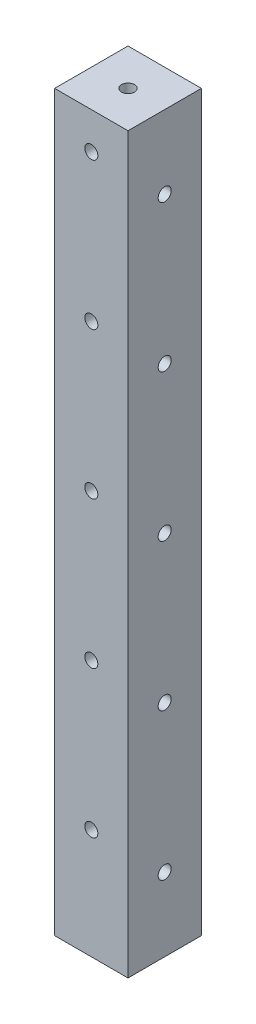
ISO-10303-21;
HEADER;
FILE_DESCRIPTION(('STEP AP214'),'2;1');
FILE_NAME('part.step','',(''),(''),'','','');
FILE_SCHEMA(('AUTOMOTIVE_DESIGN { 1 0 10303 214 1 1 1 1 }'));
ENDSEC;
DATA;
#1=APPLICATION_CONTEXT('core data for automotive mechanical design processes');
#2=APPLICATION_PROTOCOL_DEFINITION('international standard','automotive_design',2000,#1);
#3=PRODUCT_CONTEXT('',#1,'mechanical');
#4=PRODUCT('Part','Part','',(#3));
#5=PRODUCT_RELATED_PRODUCT_CATEGORY('part','',(#4));
#6=PRODUCT_DEFINITION_FORMATION('','',#4);
#7=PRODUCT_DEFINITION_CONTEXT('part definition',#1,'design');
#8=PRODUCT_DEFINITION('design','',#6,#7);
#9=PRODUCT_DEFINITION_SHAPE('','',#8);
#10=(LENGTH_UNIT() NAMED_UNIT(*) SI_UNIT(.MILLI.,.METRE.));
#11=(NAMED_UNIT(*) PLANE_ANGLE_UNIT() SI_UNIT($,.RADIAN.));
#12=(NAMED_UNIT(*) SI_UNIT($,.STERADIAN.) SOLID_ANGLE_UNIT());
#13=UNCERTAINTY_MEASURE_WITH_UNIT(LENGTH_MEASURE(1.E-05),#10,'distance_accuracy_value','');
#14=(GEOMETRIC_REPRESENTATION_CONTEXT(3) GLOBAL_UNCERTAINTY_ASSIGNED_CONTEXT((#13)) GLOBAL_UNIT_ASSIGNED_CONTEXT((#10,
#11,#12)) REPRESENTATION_CONTEXT('',''));
#15=CARTESIAN_POINT('',(0.,0.,0.));
#16=DIRECTION('',(0.,0.,1.));
#17=DIRECTION('',(1.,0.,0.));
#18=AXIS2_PLACEMENT_3D('',#15,#16,#17);
#19=CARTESIAN_POINT('',(6.35,127.,6.35));
#20=DIRECTION('',(0.,1.,0.));
#21=DIRECTION('',(0.,0.,1.));
#22=AXIS2_PLACEMENT_3D('',#19,#20,#21);
#23=CYLINDRICAL_SURFACE('',#22,1.1303);
#24=CARTESIAN_POINT('',(6.35,127.,6.35));
#25=DIRECTION('',(0.,1.,0.));
#26=DIRECTION('',(0.,0.,1.));
#27=AXIS2_PLACEMENT_3D('',#24,#25,#26);
#28=CIRCLE('',#27,1.1303);
#29=CARTESIAN_POINT('',(6.35,127.,7.4803));
#30=VERTEX_POINT('',#29);
#31=EDGE_CURVE('E170',#30,#30,#28,.T.);
#32=ORIENTED_EDGE('',*,*,#31,.T.);
#33=EDGE_LOOP('',(#32));
#34=FACE_BOUND('',#33,.T.);
#35=CARTESIAN_POINT('',(6.35,120.65,6.35));
#36=DIRECTION('',(0.,0.707106781186547,0.707106781186547));
#37=DIRECTION('',(0.,0.707106781186547,-0.707106781186547));
#38=AXIS2_PLACEMENT_3D('',#35,#36,#37);
#39=ELLIPSE('',#38,1.5984855895503,1.13029999999999);
#40=CARTESIAN_POINT('',(5.2197,120.65,6.35));
#41=VERTEX_POINT('',#40);
#42=CARTESIAN_POINT('',(7.48029999999999,120.65,6.35));
#43=VERTEX_POINT('',#42);
#44=EDGE_CURVE('E59',#41,#43,#39,.F.);
#45=ORIENTED_EDGE('',*,*,#44,.T.);
#46=CARTESIAN_POINT('',(6.35,120.65,6.35));
#47=DIRECTION('',(0.,0.707106781186547,-0.707106781186547));
#48=DIRECTION('',(0.,0.707106781186547,0.707106781186547));
#49=AXIS2_PLACEMENT_3D('',#46,#47,#48);
#50=ELLIPSE('',#49,1.5984855895503,1.13029999999999);
#51=EDGE_CURVE('E11',#43,#41,#50,.F.);
#52=ORIENTED_EDGE('',*,*,#51,.T.);
#53=EDGE_LOOP('',(#45,#52));
#54=FACE_BOUND('',#53,.T.);
#55=ADVANCED_FACE('F45',(#34,#54),#23,.F.);
#56=CARTESIAN_POINT('',(0.,127.,0.));
#57=DIRECTION('',(1.,0.,0.));
#58=DIRECTION('',(0.,0.,-1.));
#59=AXIS2_PLACEMENT_3D('',#56,#57,#58);
#60=PLANE('',#59);
#61=CARTESIAN_POINT('',(0.,12.7,6.35));
#62=DIRECTION('',(-1.,0.,0.));
#63=DIRECTION('',(0.,0.,1.));
#64=AXIS2_PLACEMENT_3D('',#61,#62,#63);
#65=CIRCLE('',#64,1.13029999999999);
#66=CARTESIAN_POINT('',(0.,12.7,7.48029999999999));
#67=VERTEX_POINT('',#66);
#68=EDGE_CURVE('E250',#67,#67,#65,.T.);
#69=ORIENTED_EDGE('',*,*,#68,.F.);
#70=EDGE_LOOP('',(#69));
#71=FACE_BOUND('',#70,.T.);
#72=CARTESIAN_POINT('',(0.,38.1,6.35));
#73=DIRECTION('',(-1.,0.,0.));
#74=DIRECTION('',(0.,0.,1.));
#75=AXIS2_PLACEMENT_3D('',#72,#73,#74);
#76=CIRCLE('',#75,1.13029999999999);
#77=CARTESIAN_POINT('',(0.,38.1,7.48029999999999));
#78=VERTEX_POINT('',#77);
#79=EDGE_CURVE('E242',#78,#78,#76,.T.);
#80=ORIENTED_EDGE('',*,*,#79,.F.);
#81=EDGE_LOOP('',(#80));
#82=FACE_BOUND('',#81,.T.);
#83=CARTESIAN_POINT('',(0.,63.5,6.35));
#84=DIRECTION('',(-1.,0.,0.));
#85=DIRECTION('',(0.,0.,1.));
#86=AXIS2_PLACEMENT_3D('',#83,#84,#85);
#87=CIRCLE('',#86,1.13029999999999);
#88=CARTESIAN_POINT('',(0.,63.5,7.48029999999999));
#89=VERTEX_POINT('',#88);
#90=EDGE_CURVE('E234',#89,#89,#87,.T.);
#91=ORIENTED_EDGE('',*,*,#90,.F.);
#92=EDGE_LOOP('',(#91));
#93=FACE_BOUND('',#92,.T.);
#94=CARTESIAN_POINT('',(0.,88.9,6.35));
#95=DIRECTION('',(-1.,0.,0.));
#96=DIRECTION('',(0.,0.,1.));
#97=AXIS2_PLACEMENT_3D('',#94,#95,#96);
#98=CIRCLE('',#97,1.13029999999999);
#99=CARTESIAN_POINT('',(0.,88.9,7.48029999999999));
#100=VERTEX_POINT('',#99);
#101=EDGE_CURVE('E226',#100,#100,#98,.T.);
#102=ORIENTED_EDGE('',*,*,#101,.F.);
#103=EDGE_LOOP('',(#102));
#104=FACE_BOUND('',#103,.T.);
#105=CARTESIAN_POINT('',(0.,114.3,6.35));
#106=DIRECTION('',(-1.,0.,0.));
#107=DIRECTION('',(0.,0.,1.));
#108=AXIS2_PLACEMENT_3D('',#105,#106,#107);
#109=CIRCLE('',#108,1.13029999999999);
#110=CARTESIAN_POINT('',(0.,114.3,7.48029999999999));
#111=VERTEX_POINT('',#110);
#112=EDGE_CURVE('E218',#111,#111,#109,.T.);
#113=ORIENTED_EDGE('',*,*,#112,.F.);
#114=EDGE_LOOP('',(#113));
#115=FACE_BOUND('',#114,.T.);
#116=DIRECTION('',(0.,0.,1.));
#117=VECTOR('',#116,1.);
#118=CARTESIAN_POINT('',(0.,0.,0.));
#119=LINE('',#118,#117);
#120=CARTESIAN_POINT('',(0.,0.,0.));
#121=VERTEX_POINT('',#120);
#122=CARTESIAN_POINT('',(0.,0.,12.7));
#123=VERTEX_POINT('',#122);
#124=EDGE_CURVE('E145',#121,#123,#119,.T.);
#125=ORIENTED_EDGE('',*,*,#124,.T.);
#126=DIRECTION('',(0.,-1.,0.));
#127=VECTOR('',#126,1.);
#128=CARTESIAN_POINT('',(0.,127.,12.7));
#129=LINE('',#128,#127);
#130=CARTESIAN_POINT('',(0.,127.,12.7));
#131=VERTEX_POINT('',#130);
#132=EDGE_CURVE('E118',#131,#123,#129,.T.);
#133=ORIENTED_EDGE('',*,*,#132,.F.);
#134=DIRECTION('',(0.,0.,1.));
#135=VECTOR('',#134,1.);
#136=CARTESIAN_POINT('',(0.,127.,0.));
#137=LINE('',#136,#135);
#138=CARTESIAN_POINT('',(0.,127.,0.));
#139=VERTEX_POINT('',#138);
#140=EDGE_CURVE('E138',#139,#131,#137,.T.);
#141=ORIENTED_EDGE('',*,*,#140,.F.);
#142=DIRECTION('',(0.,-1.,0.));
#143=VECTOR('',#142,1.);
#144=CARTESIAN_POINT('',(0.,127.,0.));
#145=LINE('',#144,#143);
#146=EDGE_CURVE('E133',#139,#121,#145,.T.);
#147=ORIENTED_EDGE('',*,*,#146,.T.);
#148=EDGE_LOOP('',(#125,#133,#141,#147));
#149=FACE_BOUND('',#148,.T.);
#150=ADVANCED_FACE('F47',(#71,#82,#93,#104,#115,#149),#60,.F.);
#151=CARTESIAN_POINT('',(0.,127.,12.7));
#152=DIRECTION('',(0.,0.,-1.));
#153=DIRECTION('',(-1.,0.,0.));
#154=AXIS2_PLACEMENT_3D('',#151,#152,#153);
#155=PLANE('',#154);
#156=CARTESIAN_POINT('',(6.35,19.05,12.7));
#157=DIRECTION('',(0.,0.,-1.));
#158=DIRECTION('',(-1.,0.,0.));
#159=AXIS2_PLACEMENT_3D('',#156,#157,#158);
#160=CIRCLE('',#159,1.1303);
#161=CARTESIAN_POINT('',(5.2197,19.05,12.7));
#162=VERTEX_POINT('',#161);
#163=EDGE_CURVE('E206',#162,#162,#160,.T.);
#164=ORIENTED_EDGE('',*,*,#163,.T.);
#165=EDGE_LOOP('',(#164));
#166=FACE_BOUND('',#165,.T.);
#167=CARTESIAN_POINT('',(6.35,44.45,12.7));
#168=DIRECTION('',(0.,0.,-1.));
#169=DIRECTION('',(-1.,0.,0.));
#170=AXIS2_PLACEMENT_3D('',#167,#168,#169);
#171=CIRCLE('',#170,1.1303);
#172=CARTESIAN_POINT('',(5.2197,44.45,12.7));
#173=VERTEX_POINT('',#172);
#174=EDGE_CURVE('E198',#173,#173,#171,.T.);
#175=ORIENTED_EDGE('',*,*,#174,.T.);
#176=EDGE_LOOP('',(#175));
#177=FACE_BOUND('',#176,.T.);
#178=CARTESIAN_POINT('',(6.35,69.85,12.7));
#179=DIRECTION('',(0.,0.,-1.));
#180=DIRECTION('',(-1.,0.,0.));
#181=AXIS2_PLACEMENT_3D('',#178,#179,#180);
#182=CIRCLE('',#181,1.1303);
#183=CARTESIAN_POINT('',(5.2197,69.85,12.7));
#184=VERTEX_POINT('',#183);
#185=EDGE_CURVE('E190',#184,#184,#182,.T.);
#186=ORIENTED_EDGE('',*,*,#185,.T.);
#187=EDGE_LOOP('',(#186));
#188=FACE_BOUND('',#187,.T.);
#189=CARTESIAN_POINT('',(6.35,95.25,12.7));
#190=DIRECTION('',(0.,0.,-1.));
#191=DIRECTION('',(-1.,0.,0.));
#192=AXIS2_PLACEMENT_3D('',#189,#190,#191);
#193=CIRCLE('',#192,1.1303);
#194=CARTESIAN_POINT('',(5.2197,95.25,12.7));
#195=VERTEX_POINT('',#194);
#196=EDGE_CURVE('E182',#195,#195,#193,.T.);
#197=ORIENTED_EDGE('',*,*,#196,.T.);
#198=EDGE_LOOP('',(#197));
#199=FACE_BOUND('',#198,.T.);
#200=CARTESIAN_POINT('',(6.35,120.65,12.7));
#201=DIRECTION('',(0.,0.,-1.));
#202=DIRECTION('',(-1.,0.,0.));
#203=AXIS2_PLACEMENT_3D('',#200,#201,#202);
#204=CIRCLE('',#203,1.1303);
#205=CARTESIAN_POINT('',(5.2197,120.65,12.7));
#206=VERTEX_POINT('',#205);
#207=EDGE_CURVE('E174',#206,#206,#204,.T.);
#208=ORIENTED_EDGE('',*,*,#207,.T.);
#209=EDGE_LOOP('',(#208));
#210=FACE_BOUND('',#209,.T.);
#211=DIRECTION('',(1.,0.,0.));
#212=VECTOR('',#211,1.);
#213=CARTESIAN_POINT('',(0.,0.,12.7));
#214=LINE('',#213,#212);
#215=CARTESIAN_POINT('',(12.7,0.,12.7));
#216=VERTEX_POINT('',#215);
#217=EDGE_CURVE('E142',#123,#216,#214,.T.);
#218=ORIENTED_EDGE('',*,*,#217,.T.);
#219=DIRECTION('',(0.,-1.,0.));
#220=VECTOR('',#219,1.);
#221=CARTESIAN_POINT('',(12.7,127.,12.7));
#222=LINE('',#221,#220);
#223=CARTESIAN_POINT('',(12.7,127.,12.7));
#224=VERTEX_POINT('',#223);
#225=EDGE_CURVE('E126',#224,#216,#222,.T.);
#226=ORIENTED_EDGE('',*,*,#225,.F.);
#227=DIRECTION('',(1.,0.,0.));
#228=VECTOR('',#227,1.);
#229=CARTESIAN_POINT('',(0.,127.,12.7));
#230=LINE('',#229,#228);
#231=EDGE_CURVE('E97',#131,#224,#230,.T.);
#232=ORIENTED_EDGE('',*,*,#231,.F.);
#233=ORIENTED_EDGE('',*,*,#132,.T.);
#234=EDGE_LOOP('',(#218,#226,#232,#233));
#235=FACE_BOUND('',#234,.T.);
#236=ADVANCED_FACE('F259',(#166,#177,#188,#199,#210,#235),#155,.F.);
#237=CARTESIAN_POINT('',(12.7,127.,0.));
#238=DIRECTION('',(-1.,0.,0.));
#239=DIRECTION('',(0.,0.,1.));
#240=AXIS2_PLACEMENT_3D('',#237,#238,#239);
#241=PLANE('',#240);
#242=CARTESIAN_POINT('',(12.7,12.7,6.35));
#243=DIRECTION('',(-1.,0.,0.));
#244=DIRECTION('',(0.,0.,1.));
#245=AXIS2_PLACEMENT_3D('',#242,#243,#244);
#246=CIRCLE('',#245,1.1303);
#247=CARTESIAN_POINT('',(12.7,12.7,7.48029999999999));
#248=VERTEX_POINT('',#247);
#249=EDGE_CURVE('E246',#248,#248,#246,.T.);
#250=ORIENTED_EDGE('',*,*,#249,.T.);
#251=EDGE_LOOP('',(#250));
#252=FACE_BOUND('',#251,.T.);
#253=CARTESIAN_POINT('',(12.7,38.1,6.35));
#254=DIRECTION('',(-1.,0.,0.));
#255=DIRECTION('',(0.,0.,1.));
#256=AXIS2_PLACEMENT_3D('',#253,#254,#255);
#257=CIRCLE('',#256,1.13029999999999);
#258=CARTESIAN_POINT('',(12.7,38.1,7.48029999999999));
#259=VERTEX_POINT('',#258);
#260=EDGE_CURVE('E238',#259,#259,#257,.T.);
#261=ORIENTED_EDGE('',*,*,#260,.T.);
#262=EDGE_LOOP('',(#261));
#263=FACE_BOUND('',#262,.T.);
#264=CARTESIAN_POINT('',(12.7,63.5,6.35));
#265=DIRECTION('',(-1.,0.,0.));
#266=DIRECTION('',(0.,0.,1.));
#267=AXIS2_PLACEMENT_3D('',#264,#265,#266);
#268=CIRCLE('',#267,1.1303);
#269=CARTESIAN_POINT('',(12.7,63.5,7.4803));
#270=VERTEX_POINT('',#269);
#271=EDGE_CURVE('E230',#270,#270,#268,.T.);
#272=ORIENTED_EDGE('',*,*,#271,.T.);
#273=EDGE_LOOP('',(#272));
#274=FACE_BOUND('',#273,.T.);
#275=CARTESIAN_POINT('',(12.7,88.9,6.35));
#276=DIRECTION('',(-1.,0.,0.));
#277=DIRECTION('',(0.,0.,1.));
#278=AXIS2_PLACEMENT_3D('',#275,#276,#277);
#279=CIRCLE('',#278,1.1303);
#280=CARTESIAN_POINT('',(12.7,88.9,7.4803));
#281=VERTEX_POINT('',#280);
#282=EDGE_CURVE('E222',#281,#281,#279,.T.);
#283=ORIENTED_EDGE('',*,*,#282,.T.);
#284=EDGE_LOOP('',(#283));
#285=FACE_BOUND('',#284,.T.);
#286=CARTESIAN_POINT('',(12.7,114.3,6.35));
#287=DIRECTION('',(-1.,0.,0.));
#288=DIRECTION('',(0.,0.,1.));
#289=AXIS2_PLACEMENT_3D('',#286,#287,#288);
#290=CIRCLE('',#289,1.1303);
#291=CARTESIAN_POINT('',(12.7,114.3,7.4803));
#292=VERTEX_POINT('',#291);
#293=EDGE_CURVE('E214',#292,#292,#290,.T.);
#294=ORIENTED_EDGE('',*,*,#293,.T.);
#295=EDGE_LOOP('',(#294));
#296=FACE_BOUND('',#295,.T.);
#297=DIRECTION('',(0.,0.,-1.));
#298=VECTOR('',#297,1.);
#299=CARTESIAN_POINT('',(12.7,0.,0.));
#300=LINE('',#299,#298);
#301=CARTESIAN_POINT('',(12.7,0.,0.));
#302=VERTEX_POINT('',#301);
#303=EDGE_CURVE('E139',#216,#302,#300,.T.);
#304=ORIENTED_EDGE('',*,*,#303,.T.);
#305=DIRECTION('',(0.,-1.,0.));
#306=VECTOR('',#305,1.);
#307=CARTESIAN_POINT('',(12.7,127.,0.));
#308=LINE('',#307,#306);
#309=CARTESIAN_POINT('',(12.7,127.,0.));
#310=VERTEX_POINT('',#309);
#311=EDGE_CURVE('E130',#310,#302,#308,.T.);
#312=ORIENTED_EDGE('',*,*,#311,.F.);
#313=DIRECTION('',(0.,0.,-1.));
#314=VECTOR('',#313,1.);
#315=CARTESIAN_POINT('',(12.7,127.,0.));
#316=LINE('',#315,#314);
#317=EDGE_CURVE('E152',#224,#310,#316,.T.);
#318=ORIENTED_EDGE('',*,*,#317,.F.);
#319=ORIENTED_EDGE('',*,*,#225,.T.);
#320=EDGE_LOOP('',(#304,#312,#318,#319));
#321=FACE_BOUND('',#320,.T.);
#322=ADVANCED_FACE('F275',(#252,#263,#274,#285,#296,#321),#241,.F.);
#323=CARTESIAN_POINT('',(0.,127.,0.));
#324=DIRECTION('',(0.,0.,1.));
#325=DIRECTION('',(1.,0.,0.));
#326=AXIS2_PLACEMENT_3D('',#323,#324,#325);
#327=PLANE('',#326);
#328=CARTESIAN_POINT('',(6.35,19.05,0.));
#329=DIRECTION('',(0.,0.,-1.));
#330=DIRECTION('',(-1.,0.,0.));
#331=AXIS2_PLACEMENT_3D('',#328,#329,#330);
#332=CIRCLE('',#331,1.13029999999999);
#333=CARTESIAN_POINT('',(5.21970000000001,19.05,0.));
#334=VERTEX_POINT('',#333);
#335=EDGE_CURVE('E210',#334,#334,#332,.T.);
#336=ORIENTED_EDGE('',*,*,#335,.F.);
#337=EDGE_LOOP('',(#336));
#338=FACE_BOUND('',#337,.T.);
#339=CARTESIAN_POINT('',(6.35,44.45,0.));
#340=DIRECTION('',(0.,0.,-1.));
#341=DIRECTION('',(-1.,0.,0.));
#342=AXIS2_PLACEMENT_3D('',#339,#340,#341);
#343=CIRCLE('',#342,1.13029999999999);
#344=CARTESIAN_POINT('',(5.21970000000001,44.45,0.));
#345=VERTEX_POINT('',#344);
#346=EDGE_CURVE('E202',#345,#345,#343,.T.);
#347=ORIENTED_EDGE('',*,*,#346,.F.);
#348=EDGE_LOOP('',(#347));
#349=FACE_BOUND('',#348,.T.);
#350=CARTESIAN_POINT('',(6.35,69.85,0.));
#351=DIRECTION('',(0.,0.,-1.));
#352=DIRECTION('',(-1.,0.,0.));
#353=AXIS2_PLACEMENT_3D('',#350,#351,#352);
#354=CIRCLE('',#353,1.13029999999999);
#355=CARTESIAN_POINT('',(5.21970000000001,69.85,0.));
#356=VERTEX_POINT('',#355);
#357=EDGE_CURVE('E194',#356,#356,#354,.T.);
#358=ORIENTED_EDGE('',*,*,#357,.F.);
#359=EDGE_LOOP('',(#358));
#360=FACE_BOUND('',#359,.T.);
#361=CARTESIAN_POINT('',(6.35,95.25,0.));
#362=DIRECTION('',(0.,0.,-1.));
#363=DIRECTION('',(-1.,0.,0.));
#364=AXIS2_PLACEMENT_3D('',#361,#362,#363);
#365=CIRCLE('',#364,1.13029999999999);
#366=CARTESIAN_POINT('',(5.21970000000001,95.25,0.));
#367=VERTEX_POINT('',#366);
#368=EDGE_CURVE('E186',#367,#367,#365,.T.);
#369=ORIENTED_EDGE('',*,*,#368,.F.);
#370=EDGE_LOOP('',(#369));
#371=FACE_BOUND('',#370,.T.);
#372=CARTESIAN_POINT('',(6.35,120.65,0.));
#373=DIRECTION('',(0.,0.,-1.));
#374=DIRECTION('',(-1.,0.,0.));
#375=AXIS2_PLACEMENT_3D('',#372,#373,#374);
#376=CIRCLE('',#375,1.13029999999999);
#377=CARTESIAN_POINT('',(5.21970000000001,120.65,0.));
#378=VERTEX_POINT('',#377);
#379=EDGE_CURVE('E178',#378,#378,#376,.T.);
#380=ORIENTED_EDGE('',*,*,#379,.F.);
#381=EDGE_LOOP('',(#380));
#382=FACE_BOUND('',#381,.T.);
#383=DIRECTION('',(-1.,0.,0.));
#384=VECTOR('',#383,1.);
#385=CARTESIAN_POINT('',(0.,0.,0.));
#386=LINE('',#385,#384);
#387=EDGE_CURVE('E89',#302,#121,#386,.T.);
#388=ORIENTED_EDGE('',*,*,#387,.T.);
#389=ORIENTED_EDGE('',*,*,#146,.F.);
#390=DIRECTION('',(-1.,0.,0.));
#391=VECTOR('',#390,1.);
#392=CARTESIAN_POINT('',(0.,127.,0.));
#393=LINE('',#392,#391);
#394=EDGE_CURVE('E68',#310,#139,#393,.T.);
#395=ORIENTED_EDGE('',*,*,#394,.F.);
#396=ORIENTED_EDGE('',*,*,#311,.T.);
#397=EDGE_LOOP('',(#388,#389,#395,#396));
#398=FACE_BOUND('',#397,.T.);
#399=ADVANCED_FACE('F280',(#338,#349,#360,#371,#382,#398),#327,.F.);
#400=CARTESIAN_POINT('',(0.,127.,0.));
#401=DIRECTION('',(0.,1.,0.));
#402=DIRECTION('',(0.,0.,1.));
#403=AXIS2_PLACEMENT_3D('',#400,#401,#402);
#404=PLANE('',#403);
#405=ORIENTED_EDGE('',*,*,#31,.F.);
#406=EDGE_LOOP('',(#405));
#407=FACE_BOUND('',#406,.T.);
#408=ORIENTED_EDGE('',*,*,#140,.T.);
#409=ORIENTED_EDGE('',*,*,#231,.T.);
#410=ORIENTED_EDGE('',*,*,#317,.T.);
#411=ORIENTED_EDGE('',*,*,#394,.T.);
#412=EDGE_LOOP('',(#408,#409,#410,#411));
#413=FACE_BOUND('',#412,.T.);
#414=ADVANCED_FACE('F314',(#407,#413),#404,.T.);
#415=CARTESIAN_POINT('',(0.,0.,0.));
#416=DIRECTION('',(0.,1.,0.));
#417=DIRECTION('',(0.,0.,1.));
#418=AXIS2_PLACEMENT_3D('',#415,#416,#417);
#419=PLANE('',#418);
#420=CARTESIAN_POINT('',(6.35,0.,6.35));
#421=DIRECTION('',(0.,-1.,0.));
#422=DIRECTION('',(0.,0.,-1.));
#423=AXIS2_PLACEMENT_3D('',#420,#421,#422);
#424=CIRCLE('',#423,1.1303);
#425=CARTESIAN_POINT('',(6.35,0.,5.2197));
#426=VERTEX_POINT('',#425);
#427=EDGE_CURVE('E162',#426,#426,#424,.T.);
#428=ORIENTED_EDGE('',*,*,#427,.F.);
#429=EDGE_LOOP('',(#428));
#430=FACE_BOUND('',#429,.T.);
#431=ORIENTED_EDGE('',*,*,#124,.F.);
#432=ORIENTED_EDGE('',*,*,#387,.F.);
#433=ORIENTED_EDGE('',*,*,#303,.F.);
#434=ORIENTED_EDGE('',*,*,#217,.F.);
#435=EDGE_LOOP('',(#431,#432,#433,#434));
#436=FACE_BOUND('',#435,.T.);
#437=ADVANCED_FACE('F272',(#430,#436),#419,.F.);
#438=CARTESIAN_POINT('',(6.35,7.6,6.35));
#439=DIRECTION('',(0.,-1.,0.));
#440=DIRECTION('',(0.,0.,-1.));
#441=AXIS2_PLACEMENT_3D('',#438,#439,#440);
#442=CONICAL_SURFACE('',#441,1.1303,1.02974425867665);
#443=CARTESIAN_POINT('',(6.35,8.27915275768685,6.35));
#444=VERTEX_POINT('',#443);
#445=VERTEX_LOOP('',#444);
#446=FACE_BOUND('',#445,.T.);
#447=CARTESIAN_POINT('',(6.35,7.6,6.35));
#448=DIRECTION('',(0.,-1.,0.));
#449=DIRECTION('',(0.,0.,-1.));
#450=AXIS2_PLACEMENT_3D('',#447,#448,#449);
#451=CIRCLE('',#450,1.1303);
#452=CARTESIAN_POINT('',(6.35,7.6,5.2197));
#453=VERTEX_POINT('',#452);
#454=EDGE_CURVE('E149',#453,#453,#451,.T.);
#455=ORIENTED_EDGE('',*,*,#454,.T.);
#456=EDGE_LOOP('',(#455));
#457=FACE_BOUND('',#456,.T.);
#458=ADVANCED_FACE('F309',(#446,#457),#442,.F.);
#459=CARTESIAN_POINT('',(6.35,0.,6.35));
#460=DIRECTION('',(0.,-1.,0.));
#461=DIRECTION('',(0.,0.,-1.));
#462=AXIS2_PLACEMENT_3D('',#459,#460,#461);
#463=CYLINDRICAL_SURFACE('',#462,1.1303);
#464=ORIENTED_EDGE('',*,*,#454,.F.);
#465=EDGE_LOOP('',(#464));
#466=FACE_BOUND('',#465,.T.);
#467=ORIENTED_EDGE('',*,*,#427,.T.);
#468=EDGE_LOOP('',(#467));
#469=FACE_BOUND('',#468,.T.);
#470=ADVANCED_FACE('F303',(#466,#469),#463,.F.);
#471=CARTESIAN_POINT('',(6.35,120.65,0.));
#472=DIRECTION('',(0.,0.,-1.));
#473=DIRECTION('',(-1.,0.,0.));
#474=AXIS2_PLACEMENT_3D('',#471,#472,#473);
#475=CYLINDRICAL_SURFACE('',#474,1.13029999999999);
#476=ORIENTED_EDGE('',*,*,#379,.T.);
#477=EDGE_LOOP('',(#476));
#478=FACE_BOUND('',#477,.T.);
#479=ORIENTED_EDGE('',*,*,#44,.F.);
#480=CARTESIAN_POINT('',(6.35,120.65,6.35));
#481=DIRECTION('',(0.,0.707106781186547,-0.707106781186547));
#482=DIRECTION('',(0.,0.707106781186547,0.707106781186547));
#483=AXIS2_PLACEMENT_3D('',#480,#481,#482);
#484=ELLIPSE('',#483,1.5984855895503,1.13029999999999);
#485=EDGE_CURVE('E54',#43,#41,#484,.T.);
#486=ORIENTED_EDGE('',*,*,#485,.F.);
#487=EDGE_LOOP('',(#479,#486));
#488=FACE_BOUND('',#487,.T.);
#489=ADVANCED_FACE('F116',(#478,#488),#475,.F.);
#490=CARTESIAN_POINT('',(6.35,119.4,6.35));
#491=DIRECTION('',(0.,1.,0.));
#492=DIRECTION('',(0.,0.,1.));
#493=AXIS2_PLACEMENT_3D('',#490,#491,#492);
#494=CONICAL_SURFACE('',#493,1.1303,1.02974425867665);
#495=CARTESIAN_POINT('',(6.35,118.720847242313,6.35));
#496=VERTEX_POINT('',#495);
#497=VERTEX_LOOP('',#496);
#498=FACE_BOUND('',#497,.T.);
#499=CARTESIAN_POINT('',(6.35,119.4,6.35));
#500=DIRECTION('',(0.,1.,0.));
#501=DIRECTION('',(0.,0.,1.));
#502=AXIS2_PLACEMENT_3D('',#499,#500,#501);
#503=CIRCLE('',#502,1.1303);
#504=CARTESIAN_POINT('',(6.35,119.4,7.4803));
#505=VERTEX_POINT('',#504);
#506=EDGE_CURVE('E166',#505,#505,#503,.T.);
#507=ORIENTED_EDGE('',*,*,#506,.T.);
#508=EDGE_LOOP('',(#507));
#509=FACE_BOUND('',#508,.T.);
#510=ADVANCED_FACE('F292',(#498,#509),#494,.F.);
#511=CARTESIAN_POINT('',(6.35,120.65,6.35));
#512=DIRECTION('',(0.,0.707106781186547,0.707106781186547));
#513=DIRECTION('',(0.,0.707106781186547,-0.707106781186547));
#514=AXIS2_PLACEMENT_3D('',#511,#512,#513);
#515=ELLIPSE('',#514,1.5984855895503,1.13029999999999);
#516=EDGE_CURVE('E109',#41,#43,#515,.T.);
#517=ORIENTED_EDGE('',*,*,#516,.T.);
#518=ORIENTED_EDGE('',*,*,#485,.T.);
#519=EDGE_LOOP('',(#517,#518));
#520=FACE_BOUND('',#519,.T.);
#521=ORIENTED_EDGE('',*,*,#506,.F.);
#522=EDGE_LOOP('',(#521));
#523=FACE_BOUND('',#522,.T.);
#524=ADVANCED_FACE('F120',(#520,#523),#23,.F.);
#525=ORIENTED_EDGE('',*,*,#207,.F.);
#526=EDGE_LOOP('',(#525));
#527=FACE_BOUND('',#526,.T.);
#528=ORIENTED_EDGE('',*,*,#516,.F.);
#529=ORIENTED_EDGE('',*,*,#51,.F.);
#530=EDGE_LOOP('',(#528,#529));
#531=FACE_BOUND('',#530,.T.);
#532=ADVANCED_FACE('F110',(#527,#531),#475,.F.);
#533=CARTESIAN_POINT('',(6.35,95.25,0.));
#534=DIRECTION('',(0.,0.,-1.));
#535=DIRECTION('',(-1.,0.,0.));
#536=AXIS2_PLACEMENT_3D('',#533,#534,#535);
#537=CYLINDRICAL_SURFACE('',#536,1.13029999999999);
#538=ORIENTED_EDGE('',*,*,#196,.F.);
#539=EDGE_LOOP('',(#538));
#540=FACE_BOUND('',#539,.T.);
#541=ORIENTED_EDGE('',*,*,#368,.T.);
#542=EDGE_LOOP('',(#541));
#543=FACE_BOUND('',#542,.T.);
#544=ADVANCED_FACE('F297',(#540,#543),#537,.F.);
#545=CARTESIAN_POINT('',(6.35,69.85,0.));
#546=DIRECTION('',(0.,0.,-1.));
#547=DIRECTION('',(-1.,0.,0.));
#548=AXIS2_PLACEMENT_3D('',#545,#546,#547);
#549=CYLINDRICAL_SURFACE('',#548,1.13029999999999);
#550=ORIENTED_EDGE('',*,*,#185,.F.);
#551=EDGE_LOOP('',(#550));
#552=FACE_BOUND('',#551,.T.);
#553=ORIENTED_EDGE('',*,*,#357,.T.);
#554=EDGE_LOOP('',(#553));
#555=FACE_BOUND('',#554,.T.);
#556=ADVANCED_FACE('F336',(#552,#555),#549,.F.);
#557=CARTESIAN_POINT('',(6.35,44.45,0.));
#558=DIRECTION('',(0.,0.,-1.));
#559=DIRECTION('',(-1.,0.,0.));
#560=AXIS2_PLACEMENT_3D('',#557,#558,#559);
#561=CYLINDRICAL_SURFACE('',#560,1.13029999999999);
#562=ORIENTED_EDGE('',*,*,#174,.F.);
#563=EDGE_LOOP('',(#562));
#564=FACE_BOUND('',#563,.T.);
#565=ORIENTED_EDGE('',*,*,#346,.T.);
#566=EDGE_LOOP('',(#565));
#567=FACE_BOUND('',#566,.T.);
#568=ADVANCED_FACE('F342',(#564,#567),#561,.F.);
#569=CARTESIAN_POINT('',(6.35,19.05,0.));
#570=DIRECTION('',(0.,0.,-1.));
#571=DIRECTION('',(-1.,0.,0.));
#572=AXIS2_PLACEMENT_3D('',#569,#570,#571);
#573=CYLINDRICAL_SURFACE('',#572,1.13029999999999);
#574=ORIENTED_EDGE('',*,*,#163,.F.);
#575=EDGE_LOOP('',(#574));
#576=FACE_BOUND('',#575,.T.);
#577=ORIENTED_EDGE('',*,*,#335,.T.);
#578=EDGE_LOOP('',(#577));
#579=FACE_BOUND('',#578,.T.);
#580=ADVANCED_FACE('F349',(#576,#579),#573,.F.);
#581=CARTESIAN_POINT('',(0.,114.3,6.35));
#582=DIRECTION('',(-1.,0.,0.));
#583=DIRECTION('',(0.,0.,1.));
#584=AXIS2_PLACEMENT_3D('',#581,#582,#583);
#585=CYLINDRICAL_SURFACE('',#584,1.13029999999999);
#586=ORIENTED_EDGE('',*,*,#293,.F.);
#587=EDGE_LOOP('',(#586));
#588=FACE_BOUND('',#587,.T.);
#589=ORIENTED_EDGE('',*,*,#112,.T.);
#590=EDGE_LOOP('',(#589));
#591=FACE_BOUND('',#590,.T.);
#592=ADVANCED_FACE('F353',(#588,#591),#585,.F.);
#593=CARTESIAN_POINT('',(0.,88.9,6.35));
#594=DIRECTION('',(-1.,0.,0.));
#595=DIRECTION('',(0.,0.,1.));
#596=AXIS2_PLACEMENT_3D('',#593,#594,#595);
#597=CYLINDRICAL_SURFACE('',#596,1.13029999999999);
#598=ORIENTED_EDGE('',*,*,#282,.F.);
#599=EDGE_LOOP('',(#598));
#600=FACE_BOUND('',#599,.T.);
#601=ORIENTED_EDGE('',*,*,#101,.T.);
#602=EDGE_LOOP('',(#601));
#603=FACE_BOUND('',#602,.T.);
#604=ADVANCED_FACE('F357',(#600,#603),#597,.F.);
#605=CARTESIAN_POINT('',(0.,63.5,6.35));
#606=DIRECTION('',(-1.,0.,0.));
#607=DIRECTION('',(0.,0.,1.));
#608=AXIS2_PLACEMENT_3D('',#605,#606,#607);
#609=CYLINDRICAL_SURFACE('',#608,1.13029999999999);
#610=ORIENTED_EDGE('',*,*,#271,.F.);
#611=EDGE_LOOP('',(#610));
#612=FACE_BOUND('',#611,.T.);
#613=ORIENTED_EDGE('',*,*,#90,.T.);
#614=EDGE_LOOP('',(#613));
#615=FACE_BOUND('',#614,.T.);
#616=ADVANCED_FACE('F361',(#612,#615),#609,.F.);
#617=CARTESIAN_POINT('',(0.,38.1,6.35));
#618=DIRECTION('',(-1.,0.,0.));
#619=DIRECTION('',(0.,0.,1.));
#620=AXIS2_PLACEMENT_3D('',#617,#618,#619);
#621=CYLINDRICAL_SURFACE('',#620,1.13029999999999);
#622=ORIENTED_EDGE('',*,*,#260,.F.);
#623=EDGE_LOOP('',(#622));
#624=FACE_BOUND('',#623,.T.);
#625=ORIENTED_EDGE('',*,*,#79,.T.);
#626=EDGE_LOOP('',(#625));
#627=FACE_BOUND('',#626,.T.);
#628=ADVANCED_FACE('F365',(#624,#627),#621,.F.);
#629=CARTESIAN_POINT('',(0.,12.7,6.35));
#630=DIRECTION('',(-1.,0.,0.));
#631=DIRECTION('',(0.,0.,1.));
#632=AXIS2_PLACEMENT_3D('',#629,#630,#631);
#633=CYLINDRICAL_SURFACE('',#632,1.13029999999999);
#634=ORIENTED_EDGE('',*,*,#249,.F.);
#635=EDGE_LOOP('',(#634));
#636=FACE_BOUND('',#635,.T.);
#637=ORIENTED_EDGE('',*,*,#68,.T.);
#638=EDGE_LOOP('',(#637));
#639=FACE_BOUND('',#638,.T.);
#640=ADVANCED_FACE('F255',(#636,#639),#633,.F.);
#641=CLOSED_SHELL('',(#55,#150,#236,#322,#399,#414,#437,#458,#470,#489,#510,#524,#532,#544,#556,
#568,#580,#592,#604,#616,#628,#640));
#642=MANIFOLD_SOLID_BREP('B2',#641);
#643=ADVANCED_BREP_SHAPE_REPRESENTATION('',(#18,#642),#14);
#644=SHAPE_DEFINITION_REPRESENTATION(#9,#643);
ENDSEC;
END-ISO-10303-21;
